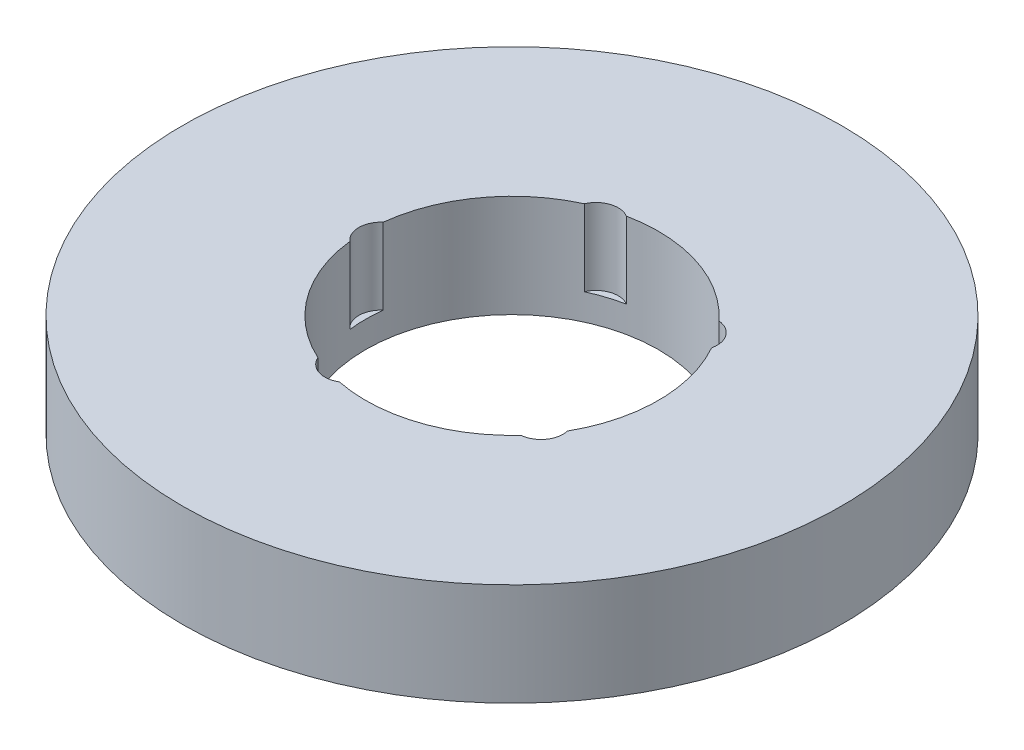
ISO-10303-21;
HEADER;
FILE_DESCRIPTION(('STEP AP214'),'2;1');
FILE_NAME('part.step','',(''),(''),'','','');
FILE_SCHEMA(('AUTOMOTIVE_DESIGN { 1 0 10303 214 1 1 1 1 }'));
ENDSEC;
DATA;
#1=APPLICATION_CONTEXT('core data for automotive mechanical design processes');
#2=APPLICATION_PROTOCOL_DEFINITION('international standard','automotive_design',2000,#1);
#3=PRODUCT_CONTEXT('',#1,'mechanical');
#4=PRODUCT('Part','Part','',(#3));
#5=PRODUCT_RELATED_PRODUCT_CATEGORY('part','',(#4));
#6=PRODUCT_DEFINITION_FORMATION('','',#4);
#7=PRODUCT_DEFINITION_CONTEXT('part definition',#1,'design');
#8=PRODUCT_DEFINITION('design','',#6,#7);
#9=PRODUCT_DEFINITION_SHAPE('','',#8);
#10=(LENGTH_UNIT() NAMED_UNIT(*) SI_UNIT(.MILLI.,.METRE.));
#11=(NAMED_UNIT(*) PLANE_ANGLE_UNIT() SI_UNIT($,.RADIAN.));
#12=(NAMED_UNIT(*) SI_UNIT($,.STERADIAN.) SOLID_ANGLE_UNIT());
#13=UNCERTAINTY_MEASURE_WITH_UNIT(LENGTH_MEASURE(1.E-05),#10,'distance_accuracy_value','');
#14=(GEOMETRIC_REPRESENTATION_CONTEXT(3) GLOBAL_UNCERTAINTY_ASSIGNED_CONTEXT((#13)) GLOBAL_UNIT_ASSIGNED_CONTEXT((#10,
#11,#12)) REPRESENTATION_CONTEXT('',''));
#15=CARTESIAN_POINT('',(0.,0.,0.));
#16=DIRECTION('',(0.,0.,1.));
#17=DIRECTION('',(1.,0.,0.));
#18=AXIS2_PLACEMENT_3D('',#15,#16,#17);
#19=CARTESIAN_POINT('',(0.,14.,0.));
#20=DIRECTION('',(0.,-1.,0.));
#21=DIRECTION('',(0.,0.,-1.));
#22=AXIS2_PLACEMENT_3D('',#19,#20,#21);
#23=CYLINDRICAL_SURFACE('',#22,45.);
#24=CARTESIAN_POINT('',(0.,14.,0.));
#25=DIRECTION('',(0.,1.,0.));
#26=DIRECTION('',(0.,0.,1.));
#27=AXIS2_PLACEMENT_3D('',#24,#25,#26);
#28=CIRCLE('',#27,45.);
#29=CARTESIAN_POINT('',(0.,14.,45.));
#30=VERTEX_POINT('',#29);
#31=EDGE_CURVE('E159',#30,#30,#28,.T.);
#32=ORIENTED_EDGE('',*,*,#31,.F.);
#33=EDGE_LOOP('',(#32));
#34=FACE_BOUND('',#33,.T.);
#35=CARTESIAN_POINT('',(0.,0.,0.));
#36=DIRECTION('',(0.,1.,0.));
#37=DIRECTION('',(0.,0.,1.));
#38=AXIS2_PLACEMENT_3D('',#35,#36,#37);
#39=CIRCLE('',#38,45.);
#40=CARTESIAN_POINT('',(0.,0.,45.));
#41=VERTEX_POINT('',#40);
#42=EDGE_CURVE('E152',#41,#41,#39,.T.);
#43=ORIENTED_EDGE('',*,*,#42,.T.);
#44=EDGE_LOOP('',(#43));
#45=FACE_BOUND('',#44,.T.);
#46=ADVANCED_FACE('F39',(#34,#45),#23,.T.);
#47=CARTESIAN_POINT('',(0.,14.,0.));
#48=DIRECTION('',(0.,1.,0.));
#49=DIRECTION('',(0.,0.,1.));
#50=AXIS2_PLACEMENT_3D('',#47,#48,#49);
#51=PLANE('',#50);
#52=CARTESIAN_POINT('',(-5.52627433406975,14.,17.0081235398808));
#53=DIRECTION('',(0.,1.,0.));
#54=DIRECTION('',(0.951056516295155,0.,0.309016994374945));
#55=AXIS2_PLACEMENT_3D('',#52,#53,#54);
#56=CIRCLE('',#55,3.02280028537796);
#57=CARTESIAN_POINT('',(-8.30708937525111,14.,18.1931928509426));
#58=VERTEX_POINT('',#57);
#59=CARTESIAN_POINT('',(-3.97311397152711,14.,19.6013868226015));
#60=VERTEX_POINT('',#59);
#61=EDGE_CURVE('E192',#58,#60,#56,.T.);
#62=ORIENTED_EDGE('',*,*,#61,.F.);
#63=CARTESIAN_POINT('',(0.,14.,0.));
#64=DIRECTION('',(0.,1.,0.));
#65=DIRECTION('',(0.,0.,1.));
#66=AXIS2_PLACEMENT_3D('',#63,#64,#65);
#67=CIRCLE('',#66,20.);
#68=CARTESIAN_POINT('',(-19.8697864038475,14.,2.27850570889678));
#69=VERTEX_POINT('',#68);
#70=EDGE_CURVE('E147',#69,#58,#67,.T.);
#71=ORIENTED_EDGE('',*,*,#70,.F.);
#72=CARTESIAN_POINT('',(-17.8833994073623,14.,0.));
#73=DIRECTION('',(0.,1.,0.));
#74=DIRECTION('',(0.,0.,1.));
#75=AXIS2_PLACEMENT_3D('',#72,#73,#74);
#76=CIRCLE('',#75,3.02280028537796);
#77=CARTESIAN_POINT('',(-19.8697864038475,14.,-2.27850570889678));
#78=VERTEX_POINT('',#77);
#79=EDGE_CURVE('E154',#78,#69,#76,.T.);
#80=ORIENTED_EDGE('',*,*,#79,.F.);
#81=CARTESIAN_POINT('',(-8.30708937525136,14.,-18.1931928509425));
#82=VERTEX_POINT('',#81);
#83=EDGE_CURVE('E136',#82,#78,#67,.T.);
#84=ORIENTED_EDGE('',*,*,#83,.F.);
#85=CARTESIAN_POINT('',(-5.52627433406999,14.,-17.0081235398807));
#86=DIRECTION('',(0.,1.,0.));
#87=DIRECTION('',(-0.95105651629515,0.,0.309016994374958));
#88=AXIS2_PLACEMENT_3D('',#85,#86,#87);
#89=CIRCLE('',#88,3.02280028537796);
#90=CARTESIAN_POINT('',(-3.9731139715274,14.,-19.6013868226015));
#91=VERTEX_POINT('',#90);
#92=EDGE_CURVE('E117',#91,#82,#89,.T.);
#93=ORIENTED_EDGE('',*,*,#92,.F.);
#94=CARTESIAN_POINT('',(14.7357228223591,14.,-13.522517254661));
#95=VERTEX_POINT('',#94);
#96=EDGE_CURVE('E133',#95,#91,#67,.T.);
#97=ORIENTED_EDGE('',*,*,#96,.F.);
#98=CARTESIAN_POINT('',(14.4679740377508,14.,-10.5115984325036));
#99=DIRECTION('',(0.,1.,0.));
#100=DIRECTION('',(-0.58778525229248,0.,-0.809016994374942));
#101=AXIS2_PLACEMENT_3D('',#98,#99,#100);
#102=CIRCLE('',#101,3.02280028537796);
#103=CARTESIAN_POINT('',(17.4142669282666,14.,-9.8358175741054));
#104=VERTEX_POINT('',#103);
#105=EDGE_CURVE('E333',#104,#95,#102,.T.);
#106=ORIENTED_EDGE('',*,*,#105,.F.);
#107=CARTESIAN_POINT('',(17.4142669282667,14.,9.83581757410515));
#108=VERTEX_POINT('',#107);
#109=EDGE_CURVE('E144',#108,#104,#67,.T.);
#110=ORIENTED_EDGE('',*,*,#109,.F.);
#111=CARTESIAN_POINT('',(14.467974037751,14.,10.5115984325034));
#112=DIRECTION('',(0.,1.,0.));
#113=DIRECTION('',(0.587785252292469,0.,-0.809016994374951));
#114=AXIS2_PLACEMENT_3D('',#111,#112,#113);
#115=CIRCLE('',#114,3.02280028537796);
#116=CARTESIAN_POINT('',(14.7357228223593,14.,13.5225172546608));
#117=VERTEX_POINT('',#116);
#118=EDGE_CURVE('E328',#117,#108,#115,.T.);
#119=ORIENTED_EDGE('',*,*,#118,.F.);
#120=EDGE_CURVE('E146',#60,#117,#67,.T.);
#121=ORIENTED_EDGE('',*,*,#120,.F.);
#122=EDGE_LOOP('',(#62,#71,#80,#84,#93,#97,#106,#110,#119,#121));
#123=FACE_BOUND('',#122,.T.);
#124=ORIENTED_EDGE('',*,*,#31,.T.);
#125=EDGE_LOOP('',(#124));
#126=FACE_BOUND('',#125,.T.);
#127=ADVANCED_FACE('F131',(#123,#126),#51,.T.);
#128=CARTESIAN_POINT('',(0.,0.,0.));
#129=DIRECTION('',(0.,1.,0.));
#130=DIRECTION('',(0.,0.,1.));
#131=AXIS2_PLACEMENT_3D('',#128,#129,#130);
#132=PLANE('',#131);
#133=CARTESIAN_POINT('',(0.,0.,0.));
#134=DIRECTION('',(0.,1.,0.));
#135=DIRECTION('',(0.,0.,1.));
#136=AXIS2_PLACEMENT_3D('',#133,#134,#135);
#137=CIRCLE('',#136,20.);
#138=CARTESIAN_POINT('',(0.,0.,20.));
#139=VERTEX_POINT('',#138);
#140=EDGE_CURVE('E149',#139,#139,#137,.T.);
#141=ORIENTED_EDGE('',*,*,#140,.T.);
#142=EDGE_LOOP('',(#141));
#143=FACE_BOUND('',#142,.T.);
#144=ORIENTED_EDGE('',*,*,#42,.F.);
#145=EDGE_LOOP('',(#144));
#146=FACE_BOUND('',#145,.T.);
#147=ADVANCED_FACE('F209',(#143,#146),#132,.F.);
#148=CARTESIAN_POINT('',(0.,14.,0.));
#149=DIRECTION('',(0.,-1.,0.));
#150=DIRECTION('',(0.,0.,-1.));
#151=AXIS2_PLACEMENT_3D('',#148,#149,#150);
#152=CYLINDRICAL_SURFACE('',#151,20.);
#153=DIRECTION('',(0.,1.,0.));
#154=VECTOR('',#153,1.);
#155=CARTESIAN_POINT('',(-8.3070893752511,8.79716142879731,18.1931928509426));
#156=LINE('',#155,#154);
#157=CARTESIAN_POINT('',(-8.30708937525111,3.59432285759463,18.1931928509426));
#158=VERTEX_POINT('',#157);
#159=EDGE_CURVE('E11',#158,#58,#156,.T.);
#160=ORIENTED_EDGE('',*,*,#159,.F.);
#161=CARTESIAN_POINT('',(0.,3.59432285759463,0.));
#162=DIRECTION('',(0.,1.,0.));
#163=DIRECTION('',(0.,0.,1.));
#164=AXIS2_PLACEMENT_3D('',#161,#162,#163);
#165=CIRCLE('',#164,20.);
#166=CARTESIAN_POINT('',(-3.97311397152711,3.59432285759463,19.6013868226015));
#167=VERTEX_POINT('',#166);
#168=EDGE_CURVE('E187',#158,#167,#165,.T.);
#169=ORIENTED_EDGE('',*,*,#168,.T.);
#170=DIRECTION('',(0.,1.,0.));
#171=VECTOR('',#170,1.);
#172=CARTESIAN_POINT('',(-3.97311397152712,8.79716142879731,19.6013868226015));
#173=LINE('',#172,#171);
#174=EDGE_CURVE('E46',#60,#167,#173,.F.);
#175=ORIENTED_EDGE('',*,*,#174,.F.);
#176=ORIENTED_EDGE('',*,*,#120,.T.);
#177=DIRECTION('',(0.,1.,0.));
#178=VECTOR('',#177,1.);
#179=CARTESIAN_POINT('',(14.7357228223593,8.79716142879731,13.5225172546608));
#180=LINE('',#179,#178);
#181=CARTESIAN_POINT('',(14.7357228223593,3.59432285759463,13.5225172546608));
#182=VERTEX_POINT('',#181);
#183=EDGE_CURVE('E186',#182,#117,#180,.T.);
#184=ORIENTED_EDGE('',*,*,#183,.F.);
#185=CARTESIAN_POINT('',(0.,3.59432285759463,0.));
#186=DIRECTION('',(0.,1.,0.));
#187=DIRECTION('',(0.,0.,1.));
#188=AXIS2_PLACEMENT_3D('',#185,#186,#187);
#189=CIRCLE('',#188,20.);
#190=CARTESIAN_POINT('',(17.4142669282667,3.59432285759463,9.83581757410515));
#191=VERTEX_POINT('',#190);
#192=EDGE_CURVE('E182',#182,#191,#189,.T.);
#193=ORIENTED_EDGE('',*,*,#192,.T.);
#194=DIRECTION('',(0.,1.,0.));
#195=VECTOR('',#194,1.);
#196=CARTESIAN_POINT('',(17.4142669282667,8.79716142879731,9.83581757410515));
#197=LINE('',#196,#195);
#198=EDGE_CURVE('E184',#108,#191,#197,.F.);
#199=ORIENTED_EDGE('',*,*,#198,.F.);
#200=ORIENTED_EDGE('',*,*,#109,.T.);
#201=DIRECTION('',(0.,1.,0.));
#202=VECTOR('',#201,1.);
#203=CARTESIAN_POINT('',(17.4142669282666,8.79716142879731,-9.8358175741054));
#204=LINE('',#203,#202);
#205=CARTESIAN_POINT('',(17.4142669282666,3.59432285759463,-9.8358175741054));
#206=VERTEX_POINT('',#205);
#207=EDGE_CURVE('E178',#206,#104,#204,.T.);
#208=ORIENTED_EDGE('',*,*,#207,.F.);
#209=CARTESIAN_POINT('',(0.,3.59432285759463,0.));
#210=DIRECTION('',(0.,1.,0.));
#211=DIRECTION('',(0.,0.,1.));
#212=AXIS2_PLACEMENT_3D('',#209,#210,#211);
#213=CIRCLE('',#212,20.);
#214=CARTESIAN_POINT('',(14.7357228223591,3.59432285759463,-13.522517254661));
#215=VERTEX_POINT('',#214);
#216=EDGE_CURVE('E123',#206,#215,#213,.T.);
#217=ORIENTED_EDGE('',*,*,#216,.T.);
#218=DIRECTION('',(0.,1.,0.));
#219=VECTOR('',#218,1.);
#220=CARTESIAN_POINT('',(14.7357228223591,8.79716142879731,-13.522517254661));
#221=LINE('',#220,#219);
#222=EDGE_CURVE('E145',#95,#215,#221,.F.);
#223=ORIENTED_EDGE('',*,*,#222,.F.);
#224=ORIENTED_EDGE('',*,*,#96,.T.);
#225=DIRECTION('',(0.,1.,0.));
#226=VECTOR('',#225,1.);
#227=CARTESIAN_POINT('',(-3.9731139715274,8.79716142879731,-19.6013868226015));
#228=LINE('',#227,#226);
#229=CARTESIAN_POINT('',(-3.9731139715274,3.59432285759463,-19.6013868226015));
#230=VERTEX_POINT('',#229);
#231=EDGE_CURVE('E111',#230,#91,#228,.T.);
#232=ORIENTED_EDGE('',*,*,#231,.F.);
#233=CARTESIAN_POINT('',(0.,3.59432285759463,0.));
#234=DIRECTION('',(0.,1.,0.));
#235=DIRECTION('',(0.,0.,1.));
#236=AXIS2_PLACEMENT_3D('',#233,#234,#235);
#237=CIRCLE('',#236,20.);
#238=CARTESIAN_POINT('',(-8.30708937525136,3.59432285759463,-18.1931928509425));
#239=VERTEX_POINT('',#238);
#240=EDGE_CURVE('E173',#230,#239,#237,.T.);
#241=ORIENTED_EDGE('',*,*,#240,.T.);
#242=DIRECTION('',(0.,1.,0.));
#243=VECTOR('',#242,1.);
#244=CARTESIAN_POINT('',(-8.30708937525136,8.79716142879731,-18.1931928509425));
#245=LINE('',#244,#243);
#246=EDGE_CURVE('E124',#82,#239,#245,.F.);
#247=ORIENTED_EDGE('',*,*,#246,.F.);
#248=ORIENTED_EDGE('',*,*,#83,.T.);
#249=DIRECTION('',(0.,1.,0.));
#250=VECTOR('',#249,1.);
#251=CARTESIAN_POINT('',(-19.8697864038475,8.79716142879731,-2.27850570889678));
#252=LINE('',#251,#250);
#253=CARTESIAN_POINT('',(-19.8697864038475,3.59432285759463,-2.27850570889678));
#254=VERTEX_POINT('',#253);
#255=EDGE_CURVE('E171',#254,#78,#252,.T.);
#256=ORIENTED_EDGE('',*,*,#255,.F.);
#257=CARTESIAN_POINT('',(0.,3.59432285759463,0.));
#258=DIRECTION('',(0.,1.,0.));
#259=DIRECTION('',(0.,0.,1.));
#260=AXIS2_PLACEMENT_3D('',#257,#258,#259);
#261=CIRCLE('',#260,20.);
#262=CARTESIAN_POINT('',(-19.8697864038475,3.59432285759463,2.27850570889678));
#263=VERTEX_POINT('',#262);
#264=EDGE_CURVE('E162',#254,#263,#261,.T.);
#265=ORIENTED_EDGE('',*,*,#264,.T.);
#266=DIRECTION('',(0.,1.,0.));
#267=VECTOR('',#266,1.);
#268=CARTESIAN_POINT('',(-19.8697864038475,8.79716142879731,2.27850570889678));
#269=LINE('',#268,#267);
#270=EDGE_CURVE('E169',#69,#263,#269,.F.);
#271=ORIENTED_EDGE('',*,*,#270,.F.);
#272=ORIENTED_EDGE('',*,*,#70,.T.);
#273=EDGE_LOOP('',(#160,#169,#175,#176,#184,#193,#199,#200,#208,#217,#223,#224,#232,#241,#247,
#248,#256,#265,#271,#272));
#274=FACE_BOUND('',#273,.T.);
#275=ORIENTED_EDGE('',*,*,#140,.F.);
#276=EDGE_LOOP('',(#275));
#277=FACE_BOUND('',#276,.T.);
#278=ADVANCED_FACE('F139',(#274,#277),#152,.F.);
#279=CARTESIAN_POINT('',(-17.8833994073623,3.59432285759463,0.));
#280=DIRECTION('',(0.,1.,0.));
#281=DIRECTION('',(0.,0.,1.));
#282=AXIS2_PLACEMENT_3D('',#279,#280,#281);
#283=CYLINDRICAL_SURFACE('',#282,3.02280028537796);
#284=ORIENTED_EDGE('',*,*,#255,.T.);
#285=ORIENTED_EDGE('',*,*,#79,.T.);
#286=ORIENTED_EDGE('',*,*,#270,.T.);
#287=CARTESIAN_POINT('',(-17.8833994073623,3.59432285759463,0.));
#288=DIRECTION('',(0.,1.,0.));
#289=DIRECTION('',(0.,0.,1.));
#290=AXIS2_PLACEMENT_3D('',#287,#288,#289);
#291=CIRCLE('',#290,3.02280028537796);
#292=EDGE_CURVE('E157',#254,#263,#291,.T.);
#293=ORIENTED_EDGE('',*,*,#292,.F.);
#294=EDGE_LOOP('',(#284,#285,#286,#293));
#295=FACE_BOUND('',#294,.T.);
#296=ADVANCED_FACE('F222',(#295),#283,.F.);
#297=CARTESIAN_POINT('',(-17.8833994073623,3.59432285759463,0.));
#298=DIRECTION('',(0.,1.,0.));
#299=DIRECTION('',(0.,0.,1.));
#300=AXIS2_PLACEMENT_3D('',#297,#298,#299);
#301=PLANE('',#300);
#302=ORIENTED_EDGE('',*,*,#292,.T.);
#303=ORIENTED_EDGE('',*,*,#264,.F.);
#304=EDGE_LOOP('',(#302,#303));
#305=FACE_BOUND('',#304,.T.);
#306=ADVANCED_FACE('F223',(#305),#301,.T.);
#307=CARTESIAN_POINT('',(-5.52627433406999,3.59432285759463,-17.0081235398807));
#308=DIRECTION('',(0.,1.,0.));
#309=DIRECTION('',(0.,0.,1.));
#310=AXIS2_PLACEMENT_3D('',#307,#308,#309);
#311=CYLINDRICAL_SURFACE('',#310,3.02280028537796);
#312=ORIENTED_EDGE('',*,*,#231,.T.);
#313=ORIENTED_EDGE('',*,*,#92,.T.);
#314=ORIENTED_EDGE('',*,*,#246,.T.);
#315=CARTESIAN_POINT('',(-5.52627433406999,3.59432285759463,-17.0081235398807));
#316=DIRECTION('',(0.,1.,0.));
#317=DIRECTION('',(-0.95105651629515,0.,0.309016994374958));
#318=AXIS2_PLACEMENT_3D('',#315,#316,#317);
#319=CIRCLE('',#318,3.02280028537796);
#320=EDGE_CURVE('E119',#230,#239,#319,.T.);
#321=ORIENTED_EDGE('',*,*,#320,.F.);
#322=EDGE_LOOP('',(#312,#313,#314,#321));
#323=FACE_BOUND('',#322,.T.);
#324=ADVANCED_FACE('F116',(#323),#311,.F.);
#325=CARTESIAN_POINT('',(-5.52627433406999,3.59432285759463,-17.0081235398807));
#326=DIRECTION('',(0.,1.,0.));
#327=DIRECTION('',(-0.95105651629515,0.,0.309016994374958));
#328=AXIS2_PLACEMENT_3D('',#325,#326,#327);
#329=PLANE('',#328);
#330=ORIENTED_EDGE('',*,*,#320,.T.);
#331=ORIENTED_EDGE('',*,*,#240,.F.);
#332=EDGE_LOOP('',(#330,#331));
#333=FACE_BOUND('',#332,.T.);
#334=ADVANCED_FACE('F235',(#333),#329,.T.);
#335=CARTESIAN_POINT('',(14.4679740377508,3.59432285759463,-10.5115984325036));
#336=DIRECTION('',(0.,1.,0.));
#337=DIRECTION('',(0.,0.,1.));
#338=AXIS2_PLACEMENT_3D('',#335,#336,#337);
#339=CYLINDRICAL_SURFACE('',#338,3.02280028537796);
#340=ORIENTED_EDGE('',*,*,#207,.T.);
#341=ORIENTED_EDGE('',*,*,#105,.T.);
#342=ORIENTED_EDGE('',*,*,#222,.T.);
#343=CARTESIAN_POINT('',(14.4679740377508,3.59432285759463,-10.5115984325036));
#344=DIRECTION('',(0.,1.,0.));
#345=DIRECTION('',(-0.58778525229248,0.,-0.809016994374942));
#346=AXIS2_PLACEMENT_3D('',#343,#344,#345);
#347=CIRCLE('',#346,3.02280028537796);
#348=EDGE_CURVE('E335',#206,#215,#347,.T.);
#349=ORIENTED_EDGE('',*,*,#348,.F.);
#350=EDGE_LOOP('',(#340,#341,#342,#349));
#351=FACE_BOUND('',#350,.T.);
#352=ADVANCED_FACE('F234',(#351),#339,.F.);
#353=CARTESIAN_POINT('',(14.4679740377508,3.59432285759463,-10.5115984325036));
#354=DIRECTION('',(0.,1.,0.));
#355=DIRECTION('',(-0.58778525229248,0.,-0.809016994374942));
#356=AXIS2_PLACEMENT_3D('',#353,#354,#355);
#357=PLANE('',#356);
#358=ORIENTED_EDGE('',*,*,#348,.T.);
#359=ORIENTED_EDGE('',*,*,#216,.F.);
#360=EDGE_LOOP('',(#358,#359));
#361=FACE_BOUND('',#360,.T.);
#362=ADVANCED_FACE('F239',(#361),#357,.T.);
#363=CARTESIAN_POINT('',(14.467974037751,3.59432285759463,10.5115984325034));
#364=DIRECTION('',(0.,1.,0.));
#365=DIRECTION('',(0.,0.,1.));
#366=AXIS2_PLACEMENT_3D('',#363,#364,#365);
#367=CYLINDRICAL_SURFACE('',#366,3.02280028537796);
#368=ORIENTED_EDGE('',*,*,#183,.T.);
#369=ORIENTED_EDGE('',*,*,#118,.T.);
#370=ORIENTED_EDGE('',*,*,#198,.T.);
#371=CARTESIAN_POINT('',(14.467974037751,3.59432285759463,10.5115984325034));
#372=DIRECTION('',(0.,1.,0.));
#373=DIRECTION('',(0.587785252292469,0.,-0.809016994374951));
#374=AXIS2_PLACEMENT_3D('',#371,#372,#373);
#375=CIRCLE('',#374,3.02280028537796);
#376=EDGE_CURVE('E56',#182,#191,#375,.T.);
#377=ORIENTED_EDGE('',*,*,#376,.F.);
#378=EDGE_LOOP('',(#368,#369,#370,#377));
#379=FACE_BOUND('',#378,.T.);
#380=ADVANCED_FACE('F242',(#379),#367,.F.);
#381=CARTESIAN_POINT('',(14.467974037751,3.59432285759463,10.5115984325034));
#382=DIRECTION('',(0.,1.,0.));
#383=DIRECTION('',(0.587785252292469,0.,-0.809016994374951));
#384=AXIS2_PLACEMENT_3D('',#381,#382,#383);
#385=PLANE('',#384);
#386=ORIENTED_EDGE('',*,*,#376,.T.);
#387=ORIENTED_EDGE('',*,*,#192,.F.);
#388=EDGE_LOOP('',(#386,#387));
#389=FACE_BOUND('',#388,.T.);
#390=ADVANCED_FACE('F205',(#389),#385,.T.);
#391=CARTESIAN_POINT('',(-5.52627433406975,3.59432285759463,17.0081235398808));
#392=DIRECTION('',(0.,1.,0.));
#393=DIRECTION('',(0.,0.,1.));
#394=AXIS2_PLACEMENT_3D('',#391,#392,#393);
#395=CYLINDRICAL_SURFACE('',#394,3.02280028537796);
#396=ORIENTED_EDGE('',*,*,#159,.T.);
#397=ORIENTED_EDGE('',*,*,#61,.T.);
#398=ORIENTED_EDGE('',*,*,#174,.T.);
#399=CARTESIAN_POINT('',(-5.52627433406975,3.59432285759463,17.0081235398808));
#400=DIRECTION('',(0.,1.,0.));
#401=DIRECTION('',(0.951056516295155,0.,0.309016994374945));
#402=AXIS2_PLACEMENT_3D('',#399,#400,#401);
#403=CIRCLE('',#402,3.02280028537796);
#404=EDGE_CURVE('E55',#158,#167,#403,.T.);
#405=ORIENTED_EDGE('',*,*,#404,.F.);
#406=EDGE_LOOP('',(#396,#397,#398,#405));
#407=FACE_BOUND('',#406,.T.);
#408=ADVANCED_FACE('F195',(#407),#395,.F.);
#409=CARTESIAN_POINT('',(-5.52627433406975,3.59432285759463,17.0081235398808));
#410=DIRECTION('',(0.,1.,0.));
#411=DIRECTION('',(0.951056516295155,0.,0.309016994374945));
#412=AXIS2_PLACEMENT_3D('',#409,#410,#411);
#413=PLANE('',#412);
#414=ORIENTED_EDGE('',*,*,#404,.T.);
#415=ORIENTED_EDGE('',*,*,#168,.F.);
#416=EDGE_LOOP('',(#414,#415));
#417=FACE_BOUND('',#416,.T.);
#418=ADVANCED_FACE('F198',(#417),#413,.T.);
#419=CLOSED_SHELL('',(#46,#127,#147,#278,#296,#306,#324,#334,#352,#362,#380,#390,#408,#418));
#420=MANIFOLD_SOLID_BREP('B2',#419);
#421=ADVANCED_BREP_SHAPE_REPRESENTATION('',(#18,#420),#14);
#422=SHAPE_DEFINITION_REPRESENTATION(#9,#421);
ENDSEC;
END-ISO-10303-21;
